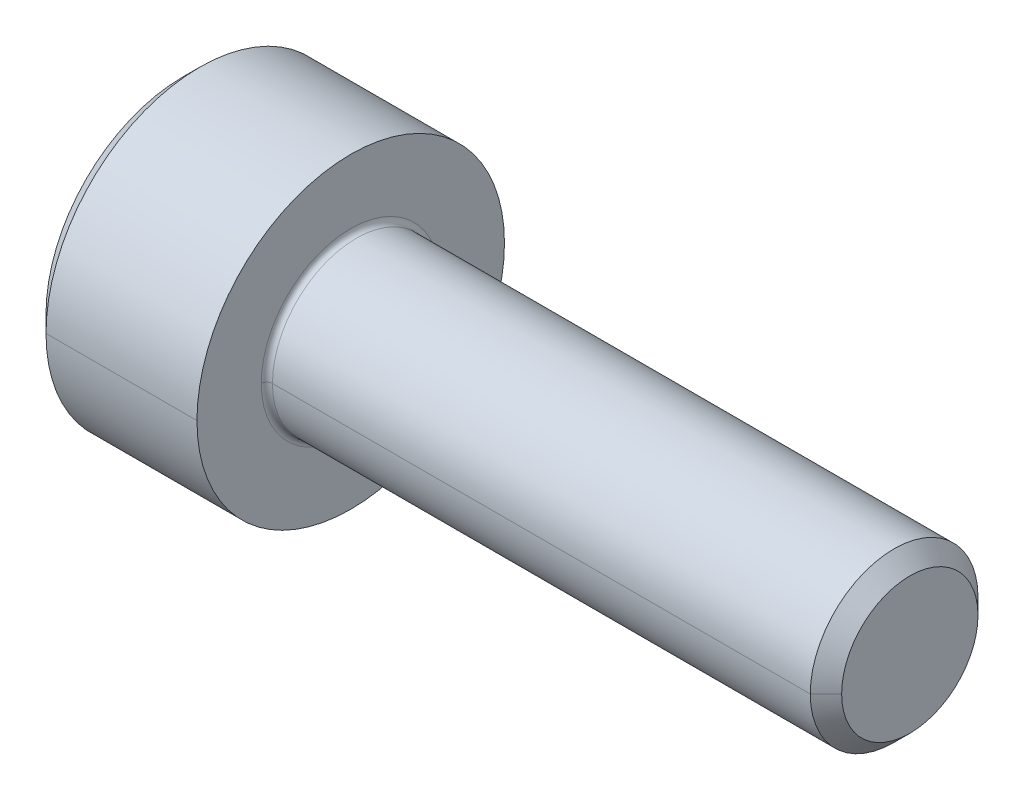
ISO-10303-21;
HEADER;
FILE_DESCRIPTION(('STEP AP214'),'2;1');
FILE_NAME('part.step','',(''),(''),'','','');
FILE_SCHEMA(('AUTOMOTIVE_DESIGN { 1 0 10303 214 1 1 1 1 }'));
ENDSEC;
DATA;
#1=APPLICATION_CONTEXT('core data for automotive mechanical design processes');
#2=APPLICATION_PROTOCOL_DEFINITION('international standard','automotive_design',2000,#1);
#3=PRODUCT_CONTEXT('',#1,'mechanical');
#4=PRODUCT('Part','Part','',(#3));
#5=PRODUCT_RELATED_PRODUCT_CATEGORY('part','',(#4));
#6=PRODUCT_DEFINITION_FORMATION('','',#4);
#7=PRODUCT_DEFINITION_CONTEXT('part definition',#1,'design');
#8=PRODUCT_DEFINITION('design','',#6,#7);
#9=PRODUCT_DEFINITION_SHAPE('','',#8);
#10=(LENGTH_UNIT() NAMED_UNIT(*) SI_UNIT(.MILLI.,.METRE.));
#11=(NAMED_UNIT(*) PLANE_ANGLE_UNIT() SI_UNIT($,.RADIAN.));
#12=(NAMED_UNIT(*) SI_UNIT($,.STERADIAN.) SOLID_ANGLE_UNIT());
#13=UNCERTAINTY_MEASURE_WITH_UNIT(LENGTH_MEASURE(1.E-05),#10,'distance_accuracy_value','');
#14=(GEOMETRIC_REPRESENTATION_CONTEXT(3) GLOBAL_UNCERTAINTY_ASSIGNED_CONTEXT((#13)) GLOBAL_UNIT_ASSIGNED_CONTEXT((#10,
#11,#12)) REPRESENTATION_CONTEXT('',''));
#15=CARTESIAN_POINT('',(0.,0.,0.));
#16=DIRECTION('',(0.,0.,1.));
#17=DIRECTION('',(1.,0.,0.));
#18=AXIS2_PLACEMENT_3D('',#15,#16,#17);
#19=CARTESIAN_POINT('',(1.3,0.,0.));
#20=DIRECTION('',(-1.,0.,0.));
#21=DIRECTION('',(0.,0.,1.));
#22=AXIS2_PLACEMENT_3D('',#19,#20,#21);
#23=CONICAL_SURFACE('',#22,1.28,1.0471975511966);
#24=DIRECTION('',(-0.5,0.,-0.866025403784438));
#25=VECTOR('',#24,1.);
#26=CARTESIAN_POINT('',(1.3,0.,-1.28));
#27=LINE('',#26,#25);
#28=CARTESIAN_POINT('',(2.03900834456273,0.,0.));
#29=VERTEX_POINT('',#28);
#30=CARTESIAN_POINT('',(1.3,0.,-1.28));
#31=VERTEX_POINT('',#30);
#32=EDGE_CURVE('E368',#29,#31,#27,.T.);
#33=ORIENTED_EDGE('',*,*,#32,.F.);
#34=DIRECTION('',(-0.5,0.,0.866025403784438));
#35=VECTOR('',#34,1.);
#36=CARTESIAN_POINT('',(1.3,0.,1.28));
#37=LINE('',#36,#35);
#38=CARTESIAN_POINT('',(1.3,0.,1.28));
#39=VERTEX_POINT('',#38);
#40=EDGE_CURVE('E385',#29,#39,#37,.T.);
#41=ORIENTED_EDGE('',*,*,#40,.T.);
#42=CARTESIAN_POINT('',(1.3,0.,0.));
#43=DIRECTION('',(-1.,0.,0.));
#44=DIRECTION('',(0.,0.,1.));
#45=AXIS2_PLACEMENT_3D('',#42,#43,#44);
#46=CIRCLE('',#45,1.28);
#47=CARTESIAN_POINT('',(1.3,1.10851251684408,0.64));
#48=VERTEX_POINT('',#47);
#49=EDGE_CURVE('E10',#39,#48,#46,.T.);
#50=ORIENTED_EDGE('',*,*,#49,.T.);
#51=CARTESIAN_POINT('',(1.3,0.,0.));
#52=DIRECTION('',(-1.,0.,0.));
#53=DIRECTION('',(0.,0.,1.));
#54=AXIS2_PLACEMENT_3D('',#51,#52,#53);
#55=CIRCLE('',#54,1.28);
#56=CARTESIAN_POINT('',(1.3,1.10851251684408,-0.64));
#57=VERTEX_POINT('',#56);
#58=EDGE_CURVE('E23',#48,#57,#55,.T.);
#59=ORIENTED_EDGE('',*,*,#58,.T.);
#60=CARTESIAN_POINT('',(1.3,0.,0.));
#61=DIRECTION('',(-1.,0.,0.));
#62=DIRECTION('',(0.,0.,1.));
#63=AXIS2_PLACEMENT_3D('',#60,#61,#62);
#64=CIRCLE('',#63,1.28);
#65=EDGE_CURVE('E281',#57,#31,#64,.T.);
#66=ORIENTED_EDGE('',*,*,#65,.T.);
#67=EDGE_LOOP('',(#33,#41,#50,#59,#66));
#68=FACE_BOUND('',#67,.T.);
#69=ADVANCED_FACE('F15',(#68),#23,.F.);
#70=CARTESIAN_POINT('',(1.3,0.73900834456272,1.28));
#71=DIRECTION('',(-1.,0.,0.));
#72=DIRECTION('',(0.,0.,1.));
#73=AXIS2_PLACEMENT_3D('',#70,#71,#72);
#74=PLANE('',#73);
#75=ORIENTED_EDGE('',*,*,#49,.F.);
#76=DIRECTION('',(0.,1.,0.));
#77=VECTOR('',#76,1.);
#78=CARTESIAN_POINT('',(1.3,-0.739008344562722,1.28));
#79=LINE('',#78,#77);
#80=CARTESIAN_POINT('',(1.3,0.73900834456272,1.28));
#81=VERTEX_POINT('',#80);
#82=EDGE_CURVE('E262',#39,#81,#79,.T.);
#83=ORIENTED_EDGE('',*,*,#82,.T.);
#84=DIRECTION('',(0.,-0.5,0.86602540378444));
#85=VECTOR('',#84,1.);
#86=CARTESIAN_POINT('',(1.3,1.47801668912544,0.));
#87=LINE('',#86,#85);
#88=EDGE_CURVE('E323',#48,#81,#87,.T.);
#89=ORIENTED_EDGE('',*,*,#88,.F.);
#90=EDGE_LOOP('',(#75,#83,#89));
#91=FACE_BOUND('',#90,.T.);
#92=ADVANCED_FACE('F827',(#91),#74,.T.);
#93=CARTESIAN_POINT('',(1.3,0.73900834456272,1.28));
#94=DIRECTION('',(-1.,0.,0.));
#95=DIRECTION('',(0.,0.,1.));
#96=AXIS2_PLACEMENT_3D('',#93,#94,#95);
#97=PLANE('',#96);
#98=ORIENTED_EDGE('',*,*,#58,.F.);
#99=DIRECTION('',(0.,-0.5,0.86602540378444));
#100=VECTOR('',#99,1.);
#101=CARTESIAN_POINT('',(1.3,1.47801668912544,0.));
#102=LINE('',#101,#100);
#103=CARTESIAN_POINT('',(1.3,1.47801668912544,0.));
#104=VERTEX_POINT('',#103);
#105=EDGE_CURVE('E319',#104,#48,#102,.T.);
#106=ORIENTED_EDGE('',*,*,#105,.F.);
#107=DIRECTION('',(0.,-0.5,-0.866025403784438));
#108=VECTOR('',#107,1.);
#109=CARTESIAN_POINT('',(1.3,1.47801668912544,0.));
#110=LINE('',#109,#108);
#111=EDGE_CURVE('E360',#104,#57,#110,.T.);
#112=ORIENTED_EDGE('',*,*,#111,.T.);
#113=EDGE_LOOP('',(#98,#106,#112));
#114=FACE_BOUND('',#113,.T.);
#115=ADVANCED_FACE('F818',(#114),#97,.T.);
#116=CARTESIAN_POINT('',(1.3,0.73900834456272,1.28));
#117=DIRECTION('',(-1.,0.,0.));
#118=DIRECTION('',(0.,0.,1.));
#119=AXIS2_PLACEMENT_3D('',#116,#117,#118);
#120=PLANE('',#119);
#121=ORIENTED_EDGE('',*,*,#65,.F.);
#122=DIRECTION('',(0.,-0.5,-0.866025403784438));
#123=VECTOR('',#122,1.);
#124=CARTESIAN_POINT('',(1.3,1.47801668912544,0.));
#125=LINE('',#124,#123);
#126=CARTESIAN_POINT('',(1.3,0.739008344562716,-1.28));
#127=VERTEX_POINT('',#126);
#128=EDGE_CURVE('E44',#57,#127,#125,.T.);
#129=ORIENTED_EDGE('',*,*,#128,.T.);
#130=DIRECTION('',(0.,-1.,0.));
#131=VECTOR('',#130,1.);
#132=CARTESIAN_POINT('',(1.3,0.739008344562716,-1.28));
#133=LINE('',#132,#131);
#134=EDGE_CURVE('E339',#127,#31,#133,.T.);
#135=ORIENTED_EDGE('',*,*,#134,.T.);
#136=EDGE_LOOP('',(#121,#129,#135));
#137=FACE_BOUND('',#136,.T.);
#138=ADVANCED_FACE('F372',(#137),#120,.T.);
#139=CARTESIAN_POINT('',(1.3,0.73900834456272,1.28));
#140=DIRECTION('',(-1.,0.,0.));
#141=DIRECTION('',(0.,0.,1.));
#142=AXIS2_PLACEMENT_3D('',#139,#140,#141);
#143=PLANE('',#142);
#144=CARTESIAN_POINT('',(1.3,0.,0.));
#145=DIRECTION('',(-1.,0.,0.));
#146=DIRECTION('',(0.,0.,1.));
#147=AXIS2_PLACEMENT_3D('',#144,#145,#146);
#148=CIRCLE('',#147,1.28);
#149=CARTESIAN_POINT('',(1.3,-1.10851251684409,-0.64));
#150=VERTEX_POINT('',#149);
#151=EDGE_CURVE('E379',#31,#150,#148,.T.);
#152=ORIENTED_EDGE('',*,*,#151,.F.);
#153=DIRECTION('',(0.,-1.,0.));
#154=VECTOR('',#153,1.);
#155=CARTESIAN_POINT('',(1.3,0.739008344562716,-1.28));
#156=LINE('',#155,#154);
#157=CARTESIAN_POINT('',(1.3,-0.739008344562726,-1.28));
#158=VERTEX_POINT('',#157);
#159=EDGE_CURVE('E336',#31,#158,#156,.T.);
#160=ORIENTED_EDGE('',*,*,#159,.T.);
#161=DIRECTION('',(0.,0.5,-0.86602540378444));
#162=VECTOR('',#161,1.);
#163=CARTESIAN_POINT('',(1.3,-1.47801668912544,0.));
#164=LINE('',#163,#162);
#165=EDGE_CURVE('E347',#150,#158,#164,.T.);
#166=ORIENTED_EDGE('',*,*,#165,.F.);
#167=EDGE_LOOP('',(#152,#160,#166));
#168=FACE_BOUND('',#167,.T.);
#169=ADVANCED_FACE('F380',(#168),#143,.T.);
#170=CARTESIAN_POINT('',(1.3,0.73900834456272,1.28));
#171=DIRECTION('',(-1.,0.,0.));
#172=DIRECTION('',(0.,0.,1.));
#173=AXIS2_PLACEMENT_3D('',#170,#171,#172);
#174=PLANE('',#173);
#175=CARTESIAN_POINT('',(1.3,0.,0.));
#176=DIRECTION('',(-1.,0.,0.));
#177=DIRECTION('',(0.,0.,1.));
#178=AXIS2_PLACEMENT_3D('',#175,#176,#177);
#179=CIRCLE('',#178,1.28);
#180=CARTESIAN_POINT('',(1.3,-1.10851251684408,0.64));
#181=VERTEX_POINT('',#180);
#182=EDGE_CURVE('E216',#150,#181,#179,.T.);
#183=ORIENTED_EDGE('',*,*,#182,.F.);
#184=DIRECTION('',(0.,0.5,-0.86602540378444));
#185=VECTOR('',#184,1.);
#186=CARTESIAN_POINT('',(1.3,-1.47801668912544,0.));
#187=LINE('',#186,#185);
#188=CARTESIAN_POINT('',(1.3,-1.47801668912544,0.));
#189=VERTEX_POINT('',#188);
#190=EDGE_CURVE('E343',#189,#150,#187,.T.);
#191=ORIENTED_EDGE('',*,*,#190,.F.);
#192=DIRECTION('',(0.,-0.5,-0.866025403784438));
#193=VECTOR('',#192,1.);
#194=CARTESIAN_POINT('',(1.3,-0.739008344562722,1.28));
#195=LINE('',#194,#193);
#196=EDGE_CURVE('E246',#181,#189,#195,.T.);
#197=ORIENTED_EDGE('',*,*,#196,.F.);
#198=EDGE_LOOP('',(#183,#191,#197));
#199=FACE_BOUND('',#198,.T.);
#200=ADVANCED_FACE('F419',(#199),#174,.T.);
#201=CARTESIAN_POINT('',(1.3,0.73900834456272,1.28));
#202=DIRECTION('',(-1.,0.,0.));
#203=DIRECTION('',(0.,0.,1.));
#204=AXIS2_PLACEMENT_3D('',#201,#202,#203);
#205=PLANE('',#204);
#206=CARTESIAN_POINT('',(1.3,0.,0.));
#207=DIRECTION('',(-1.,0.,0.));
#208=DIRECTION('',(0.,0.,1.));
#209=AXIS2_PLACEMENT_3D('',#206,#207,#208);
#210=CIRCLE('',#209,1.28);
#211=EDGE_CURVE('E207',#181,#39,#210,.T.);
#212=ORIENTED_EDGE('',*,*,#211,.F.);
#213=DIRECTION('',(0.,-0.5,-0.866025403784438));
#214=VECTOR('',#213,1.);
#215=CARTESIAN_POINT('',(1.3,-0.739008344562722,1.28));
#216=LINE('',#215,#214);
#217=CARTESIAN_POINT('',(1.3,-0.739008344562722,1.28));
#218=VERTEX_POINT('',#217);
#219=EDGE_CURVE('E242',#218,#181,#216,.T.);
#220=ORIENTED_EDGE('',*,*,#219,.F.);
#221=DIRECTION('',(0.,1.,0.));
#222=VECTOR('',#221,1.);
#223=CARTESIAN_POINT('',(1.3,-0.739008344562722,1.28));
#224=LINE('',#223,#222);
#225=EDGE_CURVE('E258',#218,#39,#224,.T.);
#226=ORIENTED_EDGE('',*,*,#225,.T.);
#227=EDGE_LOOP('',(#212,#220,#226));
#228=FACE_BOUND('',#227,.T.);
#229=ADVANCED_FACE('F784',(#228),#205,.T.);
#230=CARTESIAN_POINT('',(1.3,1.47801668912544,0.));
#231=DIRECTION('',(0.,0.866025403784438,-0.5));
#232=DIRECTION('',(-1.,0.,0.));
#233=AXIS2_PLACEMENT_3D('',#230,#231,#232);
#234=PLANE('',#233);
#235=DIRECTION('',(0.,-0.5,-0.866025403784438));
#236=VECTOR('',#235,1.);
#237=CARTESIAN_POINT('',(0.,1.47801668912544,0.));
#238=LINE('',#237,#236);
#239=CARTESIAN_POINT('',(0.,1.47801668912544,0.));
#240=VERTEX_POINT('',#239);
#241=CARTESIAN_POINT('',(0.,0.739008344562716,-1.28));
#242=VERTEX_POINT('',#241);
#243=EDGE_CURVE('E308',#240,#242,#238,.T.);
#244=ORIENTED_EDGE('',*,*,#243,.T.);
#245=DIRECTION('',(-1.,0.,0.));
#246=VECTOR('',#245,1.);
#247=CARTESIAN_POINT('',(1.3,0.739008344562716,-1.28));
#248=LINE('',#247,#246);
#249=EDGE_CURVE('E355',#127,#242,#248,.T.);
#250=ORIENTED_EDGE('',*,*,#249,.F.);
#251=ORIENTED_EDGE('',*,*,#128,.F.);
#252=ORIENTED_EDGE('',*,*,#111,.F.);
#253=DIRECTION('',(-1.,0.,0.));
#254=VECTOR('',#253,1.);
#255=CARTESIAN_POINT('',(1.3,1.47801668912544,0.));
#256=LINE('',#255,#254);
#257=EDGE_CURVE('E316',#104,#240,#256,.T.);
#258=ORIENTED_EDGE('',*,*,#257,.T.);
#259=EDGE_LOOP('',(#244,#250,#251,#252,#258));
#260=FACE_BOUND('',#259,.T.);
#261=ADVANCED_FACE('F405',(#260),#234,.F.);
#262=CARTESIAN_POINT('',(1.3,0.739008344562716,-1.28));
#263=DIRECTION('',(0.,0.,-1.));
#264=DIRECTION('',(0.,-1.,0.));
#265=AXIS2_PLACEMENT_3D('',#262,#263,#264);
#266=PLANE('',#265);
#267=DIRECTION('',(0.,-1.,0.));
#268=VECTOR('',#267,1.);
#269=CARTESIAN_POINT('',(0.,0.739008344562716,-1.28));
#270=LINE('',#269,#268);
#271=CARTESIAN_POINT('',(0.,-0.739008344562726,-1.28));
#272=VERTEX_POINT('',#271);
#273=EDGE_CURVE('E304',#242,#272,#270,.T.);
#274=ORIENTED_EDGE('',*,*,#273,.T.);
#275=DIRECTION('',(-1.,0.,0.));
#276=VECTOR('',#275,1.);
#277=CARTESIAN_POINT('',(1.3,-0.739008344562726,-1.28));
#278=LINE('',#277,#276);
#279=EDGE_CURVE('E340',#158,#272,#278,.T.);
#280=ORIENTED_EDGE('',*,*,#279,.F.);
#281=ORIENTED_EDGE('',*,*,#159,.F.);
#282=ORIENTED_EDGE('',*,*,#134,.F.);
#283=ORIENTED_EDGE('',*,*,#249,.T.);
#284=EDGE_LOOP('',(#274,#280,#281,#282,#283));
#285=FACE_BOUND('',#284,.T.);
#286=ADVANCED_FACE('F376',(#285),#266,.F.);
#287=CARTESIAN_POINT('',(1.3,-1.47801668912544,0.));
#288=DIRECTION('',(0.,0.86602540378444,0.5));
#289=DIRECTION('',(1.,0.,0.));
#290=AXIS2_PLACEMENT_3D('',#287,#288,#289);
#291=PLANE('',#290);
#292=DIRECTION('',(0.,0.5,-0.86602540378444));
#293=VECTOR('',#292,1.);
#294=CARTESIAN_POINT('',(0.,-1.47801668912544,0.));
#295=LINE('',#294,#293);
#296=CARTESIAN_POINT('',(0.,-1.47801668912544,0.));
#297=VERTEX_POINT('',#296);
#298=EDGE_CURVE('E300',#297,#272,#295,.T.);
#299=ORIENTED_EDGE('',*,*,#298,.F.);
#300=DIRECTION('',(-1.,0.,0.));
#301=VECTOR('',#300,1.);
#302=CARTESIAN_POINT('',(1.3,-1.47801668912544,0.));
#303=LINE('',#302,#301);
#304=EDGE_CURVE('E335',#189,#297,#303,.T.);
#305=ORIENTED_EDGE('',*,*,#304,.F.);
#306=ORIENTED_EDGE('',*,*,#190,.T.);
#307=ORIENTED_EDGE('',*,*,#165,.T.);
#308=ORIENTED_EDGE('',*,*,#279,.T.);
#309=EDGE_LOOP('',(#299,#305,#306,#307,#308));
#310=FACE_BOUND('',#309,.T.);
#311=ADVANCED_FACE('F416',(#310),#291,.T.);
#312=CARTESIAN_POINT('',(1.3,-0.739008344562722,1.28));
#313=DIRECTION('',(0.,0.866025403784438,-0.5));
#314=DIRECTION('',(-1.,0.,0.));
#315=AXIS2_PLACEMENT_3D('',#312,#313,#314);
#316=PLANE('',#315);
#317=DIRECTION('',(0.,-0.5,-0.866025403784438));
#318=VECTOR('',#317,1.);
#319=CARTESIAN_POINT('',(0.,-0.739008344562722,1.28));
#320=LINE('',#319,#318);
#321=CARTESIAN_POINT('',(0.,-0.739008344562722,1.28));
#322=VERTEX_POINT('',#321);
#323=EDGE_CURVE('E296',#322,#297,#320,.T.);
#324=ORIENTED_EDGE('',*,*,#323,.F.);
#325=DIRECTION('',(-1.,0.,0.));
#326=VECTOR('',#325,1.);
#327=CARTESIAN_POINT('',(1.3,-0.739008344562722,1.28));
#328=LINE('',#327,#326);
#329=EDGE_CURVE('E247',#218,#322,#328,.T.);
#330=ORIENTED_EDGE('',*,*,#329,.F.);
#331=ORIENTED_EDGE('',*,*,#219,.T.);
#332=ORIENTED_EDGE('',*,*,#196,.T.);
#333=ORIENTED_EDGE('',*,*,#304,.T.);
#334=EDGE_LOOP('',(#324,#330,#331,#332,#333));
#335=FACE_BOUND('',#334,.T.);
#336=ADVANCED_FACE('F717',(#335),#316,.T.);
#337=CARTESIAN_POINT('',(1.3,-0.739008344562722,1.28));
#338=DIRECTION('',(0.,0.,1.));
#339=DIRECTION('',(0.,-1.,0.));
#340=AXIS2_PLACEMENT_3D('',#337,#338,#339);
#341=PLANE('',#340);
#342=DIRECTION('',(0.,1.,0.));
#343=VECTOR('',#342,1.);
#344=CARTESIAN_POINT('',(0.,-0.739008344562722,1.28));
#345=LINE('',#344,#343);
#346=CARTESIAN_POINT('',(0.,0.73900834456272,1.28));
#347=VERTEX_POINT('',#346);
#348=EDGE_CURVE('E292',#322,#347,#345,.T.);
#349=ORIENTED_EDGE('',*,*,#348,.T.);
#350=DIRECTION('',(-1.,0.,0.));
#351=VECTOR('',#350,1.);
#352=CARTESIAN_POINT('',(1.3,0.73900834456272,1.28));
#353=LINE('',#352,#351);
#354=EDGE_CURVE('E327',#81,#347,#353,.T.);
#355=ORIENTED_EDGE('',*,*,#354,.F.);
#356=ORIENTED_EDGE('',*,*,#82,.F.);
#357=ORIENTED_EDGE('',*,*,#225,.F.);
#358=ORIENTED_EDGE('',*,*,#329,.T.);
#359=EDGE_LOOP('',(#349,#355,#356,#357,#358));
#360=FACE_BOUND('',#359,.T.);
#361=ADVANCED_FACE('F632',(#360),#341,.F.);
#362=CARTESIAN_POINT('',(1.3,1.47801668912544,0.));
#363=DIRECTION('',(0.,-0.86602540378444,-0.5));
#364=DIRECTION('',(0.,0.5,-0.86602540378444));
#365=AXIS2_PLACEMENT_3D('',#362,#363,#364);
#366=PLANE('',#365);
#367=DIRECTION('',(0.,-0.5,0.86602540378444));
#368=VECTOR('',#367,1.);
#369=CARTESIAN_POINT('',(0.,1.47801668912544,0.));
#370=LINE('',#369,#368);
#371=EDGE_CURVE('E288',#240,#347,#370,.T.);
#372=ORIENTED_EDGE('',*,*,#371,.F.);
#373=ORIENTED_EDGE('',*,*,#257,.F.);
#374=ORIENTED_EDGE('',*,*,#105,.T.);
#375=ORIENTED_EDGE('',*,*,#88,.T.);
#376=ORIENTED_EDGE('',*,*,#354,.T.);
#377=EDGE_LOOP('',(#372,#373,#374,#375,#376));
#378=FACE_BOUND('',#377,.T.);
#379=ADVANCED_FACE('F627',(#378),#366,.T.);
#380=CARTESIAN_POINT('',(3.1,0.,0.));
#381=DIRECTION('',(1.,0.,0.));
#382=DIRECTION('',(0.,0.,-1.));
#383=AXIS2_PLACEMENT_3D('',#380,#381,#382);
#384=TOROIDAL_SURFACE('',#383,1.6,0.1);
#385=CARTESIAN_POINT('',(3.1,0.,1.6));
#386=DIRECTION('',(0.,1.,0.));
#387=DIRECTION('',(0.,0.,1.));
#388=AXIS2_PLACEMENT_3D('',#385,#386,#387);
#389=CIRCLE('',#388,0.1);
#390=CARTESIAN_POINT('',(3.1,0.,1.5));
#391=VERTEX_POINT('',#390);
#392=CARTESIAN_POINT('',(3.,0.,1.6));
#393=VERTEX_POINT('',#392);
#394=EDGE_CURVE('E180',#391,#393,#389,.T.);
#395=ORIENTED_EDGE('',*,*,#394,.F.);
#396=CARTESIAN_POINT('',(3.1,0.,0.));
#397=DIRECTION('',(1.,0.,0.));
#398=DIRECTION('',(0.,0.,-1.));
#399=AXIS2_PLACEMENT_3D('',#396,#397,#398);
#400=CIRCLE('',#399,1.5);
#401=CARTESIAN_POINT('',(3.1,0.,-1.5));
#402=VERTEX_POINT('',#401);
#403=EDGE_CURVE('E173',#402,#391,#400,.T.);
#404=ORIENTED_EDGE('',*,*,#403,.F.);
#405=CARTESIAN_POINT('',(3.1,0.,-1.6));
#406=DIRECTION('',(0.,-1.,0.));
#407=DIRECTION('',(0.,0.,-1.));
#408=AXIS2_PLACEMENT_3D('',#405,#406,#407);
#409=CIRCLE('',#408,0.1);
#410=CARTESIAN_POINT('',(3.,0.,-1.6));
#411=VERTEX_POINT('',#410);
#412=EDGE_CURVE('E177',#402,#411,#409,.T.);
#413=ORIENTED_EDGE('',*,*,#412,.T.);
#414=CARTESIAN_POINT('',(3.,0.,0.));
#415=DIRECTION('',(-1.,0.,0.));
#416=DIRECTION('',(0.,0.,-1.));
#417=AXIS2_PLACEMENT_3D('',#414,#415,#416);
#418=CIRCLE('',#417,1.6);
#419=EDGE_CURVE('E251',#393,#411,#418,.T.);
#420=ORIENTED_EDGE('',*,*,#419,.F.);
#421=EDGE_LOOP('',(#395,#404,#413,#420));
#422=FACE_BOUND('',#421,.T.);
#423=ADVANCED_FACE('F175',(#422),#384,.F.);
#424=CARTESIAN_POINT('',(0.,0.,0.));
#425=DIRECTION('',(1.,0.,0.));
#426=DIRECTION('',(0.,0.,-1.));
#427=AXIS2_PLACEMENT_3D('',#424,#425,#426);
#428=CONICAL_SURFACE('',#427,2.45,0.78539816339744);
#429=DIRECTION('',(0.707106781186554,0.,0.707106781186542));
#430=VECTOR('',#429,1.);
#431=CARTESIAN_POINT('',(0.,0.,2.45));
#432=LINE('',#431,#430);
#433=CARTESIAN_POINT('',(0.,0.,2.45));
#434=VERTEX_POINT('',#433);
#435=CARTESIAN_POINT('',(0.3,0.,2.75));
#436=VERTEX_POINT('',#435);
#437=EDGE_CURVE('E241',#434,#436,#432,.T.);
#438=ORIENTED_EDGE('',*,*,#437,.F.);
#439=CARTESIAN_POINT('',(0.,0.,0.));
#440=DIRECTION('',(-1.,0.,0.));
#441=DIRECTION('',(0.,0.,1.));
#442=AXIS2_PLACEMENT_3D('',#439,#440,#441);
#443=CIRCLE('',#442,2.45);
#444=CARTESIAN_POINT('',(0.,0.,-2.45));
#445=VERTEX_POINT('',#444);
#446=EDGE_CURVE('E235',#445,#434,#443,.T.);
#447=ORIENTED_EDGE('',*,*,#446,.F.);
#448=DIRECTION('',(0.707106781186554,0.,-0.707106781186542));
#449=VECTOR('',#448,1.);
#450=CARTESIAN_POINT('',(0.,0.,-2.45));
#451=LINE('',#450,#449);
#452=CARTESIAN_POINT('',(0.3,0.,-2.75));
#453=VERTEX_POINT('',#452);
#454=EDGE_CURVE('E226',#445,#453,#451,.T.);
#455=ORIENTED_EDGE('',*,*,#454,.T.);
#456=CARTESIAN_POINT('',(0.3,0.,0.));
#457=DIRECTION('',(-1.,0.,0.));
#458=DIRECTION('',(0.,0.,1.));
#459=AXIS2_PLACEMENT_3D('',#456,#457,#458);
#460=CIRCLE('',#459,2.75);
#461=EDGE_CURVE('E313',#453,#436,#460,.T.);
#462=ORIENTED_EDGE('',*,*,#461,.T.);
#463=EDGE_LOOP('',(#438,#447,#455,#462));
#464=FACE_BOUND('',#463,.T.);
#465=ADVANCED_FACE('F670',(#464),#428,.T.);
#466=CARTESIAN_POINT('',(-31.75,0.,0.));
#467=DIRECTION('',(-1.,0.,0.));
#468=DIRECTION('',(0.,0.,1.));
#469=AXIS2_PLACEMENT_3D('',#466,#467,#468);
#470=CYLINDRICAL_SURFACE('',#469,2.75);
#471=DIRECTION('',(-1.,0.,0.));
#472=VECTOR('',#471,1.);
#473=CARTESIAN_POINT('',(-31.75,0.,-2.75));
#474=LINE('',#473,#472);
#475=CARTESIAN_POINT('',(3.,0.,-2.75));
#476=VERTEX_POINT('',#475);
#477=EDGE_CURVE('E225',#476,#453,#474,.T.);
#478=ORIENTED_EDGE('',*,*,#477,.F.);
#479=CARTESIAN_POINT('',(3.,0.,0.));
#480=DIRECTION('',(-1.,0.,0.));
#481=DIRECTION('',(0.,0.,1.));
#482=AXIS2_PLACEMENT_3D('',#479,#480,#481);
#483=CIRCLE('',#482,2.75);
#484=CARTESIAN_POINT('',(3.,0.,2.75));
#485=VERTEX_POINT('',#484);
#486=EDGE_CURVE('E248',#476,#485,#483,.T.);
#487=ORIENTED_EDGE('',*,*,#486,.T.);
#488=DIRECTION('',(-1.,0.,0.));
#489=VECTOR('',#488,1.);
#490=CARTESIAN_POINT('',(-31.75,0.,2.75));
#491=LINE('',#490,#489);
#492=EDGE_CURVE('E221',#485,#436,#491,.T.);
#493=ORIENTED_EDGE('',*,*,#492,.T.);
#494=ORIENTED_EDGE('',*,*,#461,.F.);
#495=EDGE_LOOP('',(#478,#487,#493,#494));
#496=FACE_BOUND('',#495,.T.);
#497=ADVANCED_FACE('F675',(#496),#470,.T.);
#498=CARTESIAN_POINT('',(3.,2.75,0.));
#499=DIRECTION('',(1.,0.,0.));
#500=DIRECTION('',(0.,1.,0.));
#501=AXIS2_PLACEMENT_3D('',#498,#499,#500);
#502=PLANE('',#501);
#503=CARTESIAN_POINT('',(3.,0.,0.));
#504=DIRECTION('',(-1.,0.,0.));
#505=DIRECTION('',(0.,0.,-1.));
#506=AXIS2_PLACEMENT_3D('',#503,#504,#505);
#507=CIRCLE('',#506,1.6);
#508=EDGE_CURVE('E201',#411,#393,#507,.T.);
#509=ORIENTED_EDGE('',*,*,#508,.T.);
#510=ORIENTED_EDGE('',*,*,#419,.T.);
#511=EDGE_LOOP('',(#509,#510));
#512=FACE_BOUND('',#511,.T.);
#513=CARTESIAN_POINT('',(3.,0.,0.));
#514=DIRECTION('',(-1.,0.,0.));
#515=DIRECTION('',(0.,0.,1.));
#516=AXIS2_PLACEMENT_3D('',#513,#514,#515);
#517=CIRCLE('',#516,2.75);
#518=EDGE_CURVE('E230',#485,#476,#517,.T.);
#519=ORIENTED_EDGE('',*,*,#518,.F.);
#520=ORIENTED_EDGE('',*,*,#486,.F.);
#521=EDGE_LOOP('',(#519,#520));
#522=FACE_BOUND('',#521,.T.);
#523=ADVANCED_FACE('F734',(#512,#522),#502,.T.);
#524=CARTESIAN_POINT('',(-31.75,0.,0.));
#525=DIRECTION('',(-1.,0.,0.));
#526=DIRECTION('',(0.,0.,1.));
#527=AXIS2_PLACEMENT_3D('',#524,#525,#526);
#528=CYLINDRICAL_SURFACE('',#527,1.5);
#529=DIRECTION('',(-1.,0.,0.));
#530=VECTOR('',#529,1.);
#531=CARTESIAN_POINT('',(-31.75,0.,-1.5));
#532=LINE('',#531,#530);
#533=CARTESIAN_POINT('',(12.7195,0.,-1.49999999999998));
#534=VERTEX_POINT('',#533);
#535=EDGE_CURVE('E186',#534,#402,#532,.T.);
#536=ORIENTED_EDGE('',*,*,#535,.F.);
#537=CARTESIAN_POINT('',(12.7195,0.,0.));
#538=DIRECTION('',(-1.,0.,0.));
#539=DIRECTION('',(0.,0.,1.));
#540=AXIS2_PLACEMENT_3D('',#537,#538,#539);
#541=CIRCLE('',#540,1.49999999999998);
#542=CARTESIAN_POINT('',(12.7195,0.,1.49999999999998));
#543=VERTEX_POINT('',#542);
#544=EDGE_CURVE('E252',#534,#543,#541,.T.);
#545=ORIENTED_EDGE('',*,*,#544,.T.);
#546=DIRECTION('',(-1.,0.,0.));
#547=VECTOR('',#546,1.);
#548=CARTESIAN_POINT('',(-31.75,0.,1.5));
#549=LINE('',#548,#547);
#550=EDGE_CURVE('E185',#543,#391,#549,.T.);
#551=ORIENTED_EDGE('',*,*,#550,.T.);
#552=CARTESIAN_POINT('',(3.1,0.,0.));
#553=DIRECTION('',(1.,0.,0.));
#554=DIRECTION('',(0.,0.,-1.));
#555=AXIS2_PLACEMENT_3D('',#552,#553,#554);
#556=CIRCLE('',#555,1.5);
#557=EDGE_CURVE('E199',#391,#402,#556,.T.);
#558=ORIENTED_EDGE('',*,*,#557,.T.);
#559=EDGE_LOOP('',(#536,#545,#551,#558));
#560=FACE_BOUND('',#559,.T.);
#561=ADVANCED_FACE('F205',(#560),#528,.T.);
#562=CARTESIAN_POINT('',(13.,0.,0.));
#563=DIRECTION('',(-1.,0.,0.));
#564=DIRECTION('',(0.,0.,1.));
#565=AXIS2_PLACEMENT_3D('',#562,#563,#564);
#566=CONICAL_SURFACE('',#565,1.2195,0.785398163397391);
#567=DIRECTION('',(-0.707106781186588,0.,-0.707106781186507));
#568=VECTOR('',#567,1.);
#569=CARTESIAN_POINT('',(13.,0.,-1.2195));
#570=LINE('',#569,#568);
#571=CARTESIAN_POINT('',(13.,0.,-1.2195));
#572=VERTEX_POINT('',#571);
#573=EDGE_CURVE('E236',#572,#534,#570,.T.);
#574=ORIENTED_EDGE('',*,*,#573,.F.);
#575=CARTESIAN_POINT('',(13.,0.,0.));
#576=DIRECTION('',(-1.,0.,0.));
#577=DIRECTION('',(0.,0.,1.));
#578=AXIS2_PLACEMENT_3D('',#575,#576,#577);
#579=CIRCLE('',#578,1.2195);
#580=CARTESIAN_POINT('',(13.,0.,1.2195));
#581=VERTEX_POINT('',#580);
#582=EDGE_CURVE('E274',#572,#581,#579,.T.);
#583=ORIENTED_EDGE('',*,*,#582,.T.);
#584=DIRECTION('',(-0.707106781186588,0.,0.707106781186507));
#585=VECTOR('',#584,1.);
#586=CARTESIAN_POINT('',(13.,0.,1.2195));
#587=LINE('',#586,#585);
#588=EDGE_CURVE('E232',#581,#543,#587,.T.);
#589=ORIENTED_EDGE('',*,*,#588,.T.);
#590=ORIENTED_EDGE('',*,*,#544,.F.);
#591=EDGE_LOOP('',(#574,#583,#589,#590));
#592=FACE_BOUND('',#591,.T.);
#593=ADVANCED_FACE('F643',(#592),#566,.T.);
#594=CARTESIAN_POINT('',(13.,1.2195,0.));
#595=DIRECTION('',(1.,0.,0.));
#596=DIRECTION('',(0.,1.,0.));
#597=AXIS2_PLACEMENT_3D('',#594,#595,#596);
#598=PLANE('',#597);
#599=CARTESIAN_POINT('',(13.,0.,0.));
#600=DIRECTION('',(-1.,0.,0.));
#601=DIRECTION('',(0.,0.,1.));
#602=AXIS2_PLACEMENT_3D('',#599,#600,#601);
#603=CIRCLE('',#602,1.2195);
#604=EDGE_CURVE('E278',#581,#572,#603,.T.);
#605=ORIENTED_EDGE('',*,*,#604,.F.);
#606=ORIENTED_EDGE('',*,*,#582,.F.);
#607=EDGE_LOOP('',(#605,#606));
#608=FACE_BOUND('',#607,.T.);
#609=ADVANCED_FACE('F620',(#608),#598,.T.);
#610=CARTESIAN_POINT('',(0.,0.,0.));
#611=DIRECTION('',(-1.,0.,0.));
#612=DIRECTION('',(0.,0.,1.));
#613=AXIS2_PLACEMENT_3D('',#610,#611,#612);
#614=PLANE('',#613);
#615=ORIENTED_EDGE('',*,*,#371,.T.);
#616=ORIENTED_EDGE('',*,*,#348,.F.);
#617=ORIENTED_EDGE('',*,*,#323,.T.);
#618=ORIENTED_EDGE('',*,*,#298,.T.);
#619=ORIENTED_EDGE('',*,*,#273,.F.);
#620=ORIENTED_EDGE('',*,*,#243,.F.);
#621=EDGE_LOOP('',(#615,#616,#617,#618,#619,#620));
#622=FACE_BOUND('',#621,.T.);
#623=ORIENTED_EDGE('',*,*,#446,.T.);
#624=CARTESIAN_POINT('',(0.,0.,0.));
#625=DIRECTION('',(-1.,0.,0.));
#626=DIRECTION('',(0.,0.,1.));
#627=AXIS2_PLACEMENT_3D('',#624,#625,#626);
#628=CIRCLE('',#627,2.45);
#629=EDGE_CURVE('E203',#434,#445,#628,.T.);
#630=ORIENTED_EDGE('',*,*,#629,.T.);
#631=EDGE_LOOP('',(#623,#630));
#632=FACE_BOUND('',#631,.T.);
#633=ADVANCED_FACE('F409',(#622,#632),#614,.T.);
#634=CARTESIAN_POINT('',(13.,0.,0.));
#635=DIRECTION('',(-1.,0.,0.));
#636=DIRECTION('',(0.,0.,1.));
#637=AXIS2_PLACEMENT_3D('',#634,#635,#636);
#638=CONICAL_SURFACE('',#637,1.2195,0.785398163397391);
#639=ORIENTED_EDGE('',*,*,#604,.T.);
#640=ORIENTED_EDGE('',*,*,#573,.T.);
#641=CARTESIAN_POINT('',(12.7195,0.,0.));
#642=DIRECTION('',(-1.,0.,0.));
#643=DIRECTION('',(0.,0.,1.));
#644=AXIS2_PLACEMENT_3D('',#641,#642,#643);
#645=CIRCLE('',#644,1.49999999999998);
#646=EDGE_CURVE('E192',#543,#534,#645,.T.);
#647=ORIENTED_EDGE('',*,*,#646,.F.);
#648=ORIENTED_EDGE('',*,*,#588,.F.);
#649=EDGE_LOOP('',(#639,#640,#647,#648));
#650=FACE_BOUND('',#649,.T.);
#651=ADVANCED_FACE('F619',(#650),#638,.T.);
#652=CARTESIAN_POINT('',(-31.75,0.,0.));
#653=DIRECTION('',(-1.,0.,0.));
#654=DIRECTION('',(0.,0.,1.));
#655=AXIS2_PLACEMENT_3D('',#652,#653,#654);
#656=CYLINDRICAL_SURFACE('',#655,1.5);
#657=ORIENTED_EDGE('',*,*,#646,.T.);
#658=ORIENTED_EDGE('',*,*,#535,.T.);
#659=ORIENTED_EDGE('',*,*,#403,.T.);
#660=ORIENTED_EDGE('',*,*,#550,.F.);
#661=EDGE_LOOP('',(#657,#658,#659,#660));
#662=FACE_BOUND('',#661,.T.);
#663=ADVANCED_FACE('F190',(#662),#656,.T.);
#664=CARTESIAN_POINT('',(-31.75,0.,0.));
#665=DIRECTION('',(-1.,0.,0.));
#666=DIRECTION('',(0.,0.,1.));
#667=AXIS2_PLACEMENT_3D('',#664,#665,#666);
#668=CYLINDRICAL_SURFACE('',#667,2.75);
#669=ORIENTED_EDGE('',*,*,#518,.T.);
#670=ORIENTED_EDGE('',*,*,#477,.T.);
#671=CARTESIAN_POINT('',(0.3,0.,0.));
#672=DIRECTION('',(-1.,0.,0.));
#673=DIRECTION('',(0.,0.,1.));
#674=AXIS2_PLACEMENT_3D('',#671,#672,#673);
#675=CIRCLE('',#674,2.75);
#676=EDGE_CURVE('E231',#436,#453,#675,.T.);
#677=ORIENTED_EDGE('',*,*,#676,.F.);
#678=ORIENTED_EDGE('',*,*,#492,.F.);
#679=EDGE_LOOP('',(#669,#670,#677,#678));
#680=FACE_BOUND('',#679,.T.);
#681=ADVANCED_FACE('F650',(#680),#668,.T.);
#682=CARTESIAN_POINT('',(0.,0.,0.));
#683=DIRECTION('',(1.,0.,0.));
#684=DIRECTION('',(0.,0.,-1.));
#685=AXIS2_PLACEMENT_3D('',#682,#683,#684);
#686=CONICAL_SURFACE('',#685,2.45,0.78539816339744);
#687=ORIENTED_EDGE('',*,*,#629,.F.);
#688=ORIENTED_EDGE('',*,*,#437,.T.);
#689=ORIENTED_EDGE('',*,*,#676,.T.);
#690=ORIENTED_EDGE('',*,*,#454,.F.);
#691=EDGE_LOOP('',(#687,#688,#689,#690));
#692=FACE_BOUND('',#691,.T.);
#693=ADVANCED_FACE('F655',(#692),#686,.T.);
#694=CARTESIAN_POINT('',(3.1,0.,0.));
#695=DIRECTION('',(1.,0.,0.));
#696=DIRECTION('',(0.,0.,-1.));
#697=AXIS2_PLACEMENT_3D('',#694,#695,#696);
#698=TOROIDAL_SURFACE('',#697,1.6,0.1);
#699=ORIENTED_EDGE('',*,*,#557,.F.);
#700=ORIENTED_EDGE('',*,*,#394,.T.);
#701=ORIENTED_EDGE('',*,*,#508,.F.);
#702=ORIENTED_EDGE('',*,*,#412,.F.);
#703=EDGE_LOOP('',(#699,#700,#701,#702));
#704=FACE_BOUND('',#703,.T.);
#705=ADVANCED_FACE('F198',(#704),#698,.F.);
#706=CARTESIAN_POINT('',(1.3,0.,0.));
#707=DIRECTION('',(-1.,0.,0.));
#708=DIRECTION('',(0.,0.,1.));
#709=AXIS2_PLACEMENT_3D('',#706,#707,#708);
#710=CONICAL_SURFACE('',#709,1.28,1.0471975511966);
#711=ORIENTED_EDGE('',*,*,#40,.F.);
#712=ORIENTED_EDGE('',*,*,#32,.T.);
#713=ORIENTED_EDGE('',*,*,#151,.T.);
#714=ORIENTED_EDGE('',*,*,#182,.T.);
#715=ORIENTED_EDGE('',*,*,#211,.T.);
#716=EDGE_LOOP('',(#711,#712,#713,#714,#715));
#717=FACE_BOUND('',#716,.T.);
#718=ADVANCED_FACE('F384',(#717),#710,.F.);
#719=CLOSED_SHELL('',(#69,#92,#115,#138,#169,#200,#229,#261,#286,#311,#336,#361,#379,#423,#465,
#497,#523,#561,#593,#609,#633,#651,#663,#681,#693,#705,#718));
#720=MANIFOLD_SOLID_BREP('B1',#719);
#721=ADVANCED_BREP_SHAPE_REPRESENTATION('',(#18,#720),#14);
#722=SHAPE_DEFINITION_REPRESENTATION(#9,#721);
ENDSEC;
END-ISO-10303-21;
